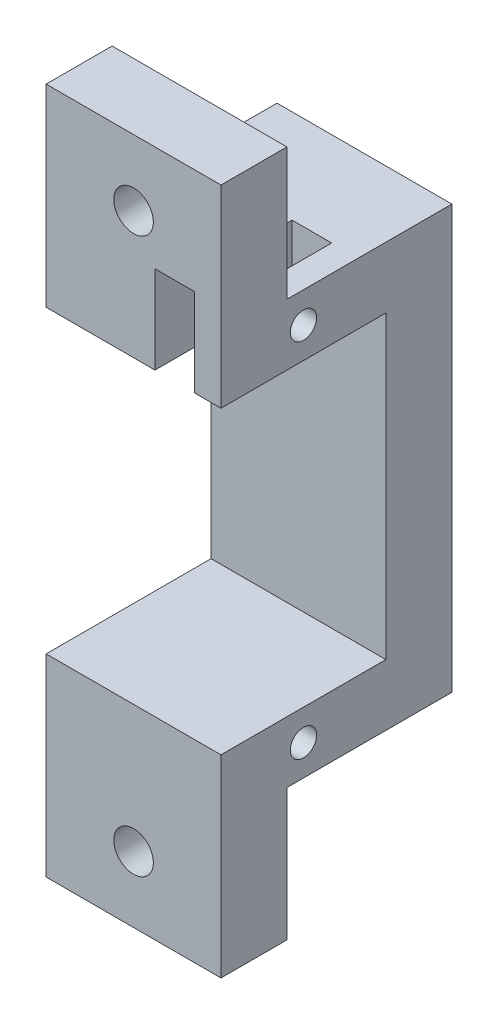
ISO-10303-21;
HEADER;
FILE_DESCRIPTION(('STEP AP214'),'2;1');
FILE_NAME('part.step','',(''),(''),'','','');
FILE_SCHEMA(('AUTOMOTIVE_DESIGN { 1 0 10303 214 1 1 1 1 }'));
ENDSEC;
DATA;
#1=APPLICATION_CONTEXT('core data for automotive mechanical design processes');
#2=APPLICATION_PROTOCOL_DEFINITION('international standard','automotive_design',2000,#1);
#3=PRODUCT_CONTEXT('',#1,'mechanical');
#4=PRODUCT('Part','Part','',(#3));
#5=PRODUCT_RELATED_PRODUCT_CATEGORY('part','',(#4));
#6=PRODUCT_DEFINITION_FORMATION('','',#4);
#7=PRODUCT_DEFINITION_CONTEXT('part definition',#1,'design');
#8=PRODUCT_DEFINITION('design','',#6,#7);
#9=PRODUCT_DEFINITION_SHAPE('','',#8);
#10=(LENGTH_UNIT() NAMED_UNIT(*) SI_UNIT(.MILLI.,.METRE.));
#11=(NAMED_UNIT(*) PLANE_ANGLE_UNIT() SI_UNIT($,.RADIAN.));
#12=(NAMED_UNIT(*) SI_UNIT($,.STERADIAN.) SOLID_ANGLE_UNIT());
#13=UNCERTAINTY_MEASURE_WITH_UNIT(LENGTH_MEASURE(1.E-05),#10,'distance_accuracy_value','');
#14=(GEOMETRIC_REPRESENTATION_CONTEXT(3) GLOBAL_UNCERTAINTY_ASSIGNED_CONTEXT((#13)) GLOBAL_UNIT_ASSIGNED_CONTEXT((#10,
#11,#12)) REPRESENTATION_CONTEXT('',''));
#15=CARTESIAN_POINT('',(0.,0.,0.));
#16=DIRECTION('',(0.,0.,1.));
#17=DIRECTION('',(1.,0.,0.));
#18=AXIS2_PLACEMENT_3D('',#15,#16,#17);
#19=CARTESIAN_POINT('',(-21.7379181981433,-2.325,12.411797698406));
#20=DIRECTION('',(1.,0.,0.));
#21=DIRECTION('',(0.,0.,-1.));
#22=AXIS2_PLACEMENT_3D('',#19,#20,#21);
#23=CYLINDRICAL_SURFACE('',#22,1.);
#24=CARTESIAN_POINT('',(-13.4879181981433,-2.325,12.411797698406));
#25=DIRECTION('',(-1.,0.,0.));
#26=DIRECTION('',(0.,0.,1.));
#27=AXIS2_PLACEMENT_3D('',#24,#25,#26);
#28=CIRCLE('',#27,1.);
#29=CARTESIAN_POINT('',(-13.4879181981433,-2.325,13.411797698406));
#30=VERTEX_POINT('',#29);
#31=EDGE_CURVE('E38',#30,#30,#28,.F.);
#32=ORIENTED_EDGE('',*,*,#31,.T.);
#33=EDGE_LOOP('',(#32));
#34=FACE_BOUND('',#33,.T.);
#35=CARTESIAN_POINT('',(-21.7379181981433,-2.325,12.411797698406));
#36=DIRECTION('',(1.,0.,0.));
#37=DIRECTION('',(0.,0.,-1.));
#38=AXIS2_PLACEMENT_3D('',#35,#36,#37);
#39=CIRCLE('',#38,1.);
#40=CARTESIAN_POINT('',(-21.7379181981433,-2.325,11.411797698406));
#41=VERTEX_POINT('',#40);
#42=EDGE_CURVE('E303',#41,#41,#39,.T.);
#43=ORIENTED_EDGE('',*,*,#42,.F.);
#44=EDGE_LOOP('',(#43));
#45=FACE_BOUND('',#44,.T.);
#46=ADVANCED_FACE('F34',(#34,#45),#23,.F.);
#47=CARTESIAN_POINT('',(-21.7379181981433,-32.05,1.16179769840603));
#48=DIRECTION('',(0.,1.,0.));
#49=DIRECTION('',(-1.,0.,0.));
#50=AXIS2_PLACEMENT_3D('',#47,#48,#49);
#51=PLANE('',#50);
#52=DIRECTION('',(1.,0.,0.));
#53=VECTOR('',#52,1.);
#54=CARTESIAN_POINT('',(-21.7379181981433,-32.05,13.661797698406));
#55=LINE('',#54,#53);
#56=CARTESIAN_POINT('',(-21.7379181981433,-32.05,13.661797698406));
#57=VERTEX_POINT('',#56);
#58=CARTESIAN_POINT('',(-8.48791819814331,-32.05,13.661797698406));
#59=VERTEX_POINT('',#58);
#60=EDGE_CURVE('E204',#57,#59,#55,.T.);
#61=ORIENTED_EDGE('',*,*,#60,.F.);
#62=DIRECTION('',(0.,0.,1.));
#63=VECTOR('',#62,1.);
#64=CARTESIAN_POINT('',(-21.7379181981433,-32.05,1.16179769840603));
#65=LINE('',#64,#63);
#66=CARTESIAN_POINT('',(-21.7379181981433,-32.05,1.16179769840603));
#67=VERTEX_POINT('',#66);
#68=EDGE_CURVE('E250',#67,#57,#65,.T.);
#69=ORIENTED_EDGE('',*,*,#68,.F.);
#70=DIRECTION('',(-1.,0.,0.));
#71=VECTOR('',#70,1.);
#72=CARTESIAN_POINT('',(-21.7379181981433,-32.05,1.16179769840603));
#73=LINE('',#72,#71);
#74=CARTESIAN_POINT('',(-8.48791819814331,-32.05,1.16179769840603));
#75=VERTEX_POINT('',#74);
#76=EDGE_CURVE('E248',#75,#67,#73,.T.);
#77=ORIENTED_EDGE('',*,*,#76,.F.);
#78=DIRECTION('',(0.,0.,1.));
#79=VECTOR('',#78,1.);
#80=CARTESIAN_POINT('',(-8.48791819814331,-32.05,1.16179769840603));
#81=LINE('',#80,#79);
#82=EDGE_CURVE('E256',#75,#59,#81,.T.);
#83=ORIENTED_EDGE('',*,*,#82,.T.);
#84=EDGE_LOOP('',(#61,#69,#77,#83));
#85=FACE_BOUND('',#84,.T.);
#86=ADVANCED_FACE('F385',(#85),#51,.F.);
#87=CARTESIAN_POINT('',(0.,0.,6.16179769840603));
#88=DIRECTION('',(0.,0.,1.));
#89=DIRECTION('',(1.,0.,0.));
#90=AXIS2_PLACEMENT_3D('',#87,#88,#89);
#91=PLANE('',#90);
#92=DIRECTION('',(0.,1.,0.));
#93=VECTOR('',#92,1.);
#94=CARTESIAN_POINT('',(-21.7379181981433,0.,6.16179769840603));
#95=LINE('',#94,#93);
#96=CARTESIAN_POINT('',(-21.7379181981433,-27.4,6.16179769840603));
#97=VERTEX_POINT('',#96);
#98=CARTESIAN_POINT('',(-21.7379181981433,-4.65,6.16179769840603));
#99=VERTEX_POINT('',#98);
#100=EDGE_CURVE('E238',#97,#99,#95,.T.);
#101=ORIENTED_EDGE('',*,*,#100,.F.);
#102=DIRECTION('',(-1.,0.,0.));
#103=VECTOR('',#102,1.);
#104=CARTESIAN_POINT('',(-8.48791819814331,-27.4,6.16179769840603));
#105=LINE('',#104,#103);
#106=CARTESIAN_POINT('',(-8.48791819814331,-27.4,6.16179769840603));
#107=VERTEX_POINT('',#106);
#108=EDGE_CURVE('E224',#107,#97,#105,.T.);
#109=ORIENTED_EDGE('',*,*,#108,.F.);
#110=DIRECTION('',(0.,-1.,0.));
#111=VECTOR('',#110,1.);
#112=CARTESIAN_POINT('',(-8.4879181981433,0.,6.16179769840603));
#113=LINE('',#112,#111);
#114=CARTESIAN_POINT('',(-8.4879181981433,-4.65,6.16179769840603));
#115=VERTEX_POINT('',#114);
#116=EDGE_CURVE('E243',#115,#107,#113,.T.);
#117=ORIENTED_EDGE('',*,*,#116,.F.);
#118=DIRECTION('',(-1.,0.,0.));
#119=VECTOR('',#118,1.);
#120=CARTESIAN_POINT('',(-21.7379181981433,-4.65,6.16179769840603));
#121=LINE('',#120,#119);
#122=EDGE_CURVE('E268',#115,#99,#121,.T.);
#123=ORIENTED_EDGE('',*,*,#122,.T.);
#124=EDGE_LOOP('',(#101,#109,#117,#123));
#125=FACE_BOUND('',#124,.T.);
#126=ADVANCED_FACE('F362',(#125),#91,.T.);
#127=CARTESIAN_POINT('',(-21.7379181981433,-4.65,6.16179769840603));
#128=DIRECTION('',(-1.,0.,0.));
#129=DIRECTION('',(0.,0.,1.));
#130=AXIS2_PLACEMENT_3D('',#127,#128,#129);
#131=PLANE('',#130);
#132=CARTESIAN_POINT('',(-21.7379181981433,-29.725,12.411797698406));
#133=DIRECTION('',(1.,0.,0.));
#134=DIRECTION('',(0.,0.,-1.));
#135=AXIS2_PLACEMENT_3D('',#132,#133,#134);
#136=CIRCLE('',#135,1.);
#137=CARTESIAN_POINT('',(-21.7379181981433,-29.725,11.411797698406));
#138=VERTEX_POINT('',#137);
#139=EDGE_CURVE('E297',#138,#138,#136,.T.);
#140=ORIENTED_EDGE('',*,*,#139,.T.);
#141=EDGE_LOOP('',(#140));
#142=FACE_BOUND('',#141,.T.);
#143=ORIENTED_EDGE('',*,*,#42,.T.);
#144=EDGE_LOOP('',(#143));
#145=FACE_BOUND('',#144,.T.);
#146=DIRECTION('',(0.,0.,1.));
#147=VECTOR('',#146,1.);
#148=CARTESIAN_POINT('',(-21.7379181981433,0.,6.16179769840603));
#149=LINE('',#148,#147);
#150=CARTESIAN_POINT('',(-21.7379181981433,0.,1.16179769840603));
#151=VERTEX_POINT('',#150);
#152=CARTESIAN_POINT('',(-21.7379181981433,0.,13.661797698406));
#153=VERTEX_POINT('',#152);
#154=EDGE_CURVE('E187',#151,#153,#149,.T.);
#155=ORIENTED_EDGE('',*,*,#154,.F.);
#156=DIRECTION('',(0.,1.,0.));
#157=VECTOR('',#156,1.);
#158=CARTESIAN_POINT('',(-21.7379181981433,0.,1.16179769840603));
#159=LINE('',#158,#157);
#160=EDGE_CURVE('E239',#67,#151,#159,.T.);
#161=ORIENTED_EDGE('',*,*,#160,.F.);
#162=ORIENTED_EDGE('',*,*,#68,.T.);
#163=DIRECTION('',(0.,1.,0.));
#164=VECTOR('',#163,1.);
#165=CARTESIAN_POINT('',(-21.7379181981433,-42.05,13.661797698406));
#166=LINE('',#165,#164);
#167=CARTESIAN_POINT('',(-21.7379181981433,-42.05,13.661797698406));
#168=VERTEX_POINT('',#167);
#169=EDGE_CURVE('E221',#168,#57,#166,.T.);
#170=ORIENTED_EDGE('',*,*,#169,.F.);
#171=DIRECTION('',(0.,0.,-1.));
#172=VECTOR('',#171,1.);
#173=CARTESIAN_POINT('',(-21.7379181981433,-42.05,18.661797698406));
#174=LINE('',#173,#172);
#175=CARTESIAN_POINT('',(-21.7379181981433,-42.05,18.661797698406));
#176=VERTEX_POINT('',#175);
#177=EDGE_CURVE('E205',#176,#168,#174,.T.);
#178=ORIENTED_EDGE('',*,*,#177,.F.);
#179=DIRECTION('',(0.,-1.,0.));
#180=VECTOR('',#179,1.);
#181=CARTESIAN_POINT('',(-21.7379181981433,-32.05,18.661797698406));
#182=LINE('',#181,#180);
#183=CARTESIAN_POINT('',(-21.7379181981433,-27.4,18.661797698406));
#184=VERTEX_POINT('',#183);
#185=EDGE_CURVE('E230',#184,#176,#182,.T.);
#186=ORIENTED_EDGE('',*,*,#185,.F.);
#187=DIRECTION('',(0.,0.,-1.));
#188=VECTOR('',#187,1.);
#189=CARTESIAN_POINT('',(-21.7379181981433,-27.4,18.661797698406));
#190=LINE('',#189,#188);
#191=EDGE_CURVE('E232',#184,#97,#190,.T.);
#192=ORIENTED_EDGE('',*,*,#191,.T.);
#193=ORIENTED_EDGE('',*,*,#100,.T.);
#194=DIRECTION('',(0.,0.,1.));
#195=VECTOR('',#194,1.);
#196=CARTESIAN_POINT('',(-21.7379181981433,-4.65,6.16179769840603));
#197=LINE('',#196,#195);
#198=CARTESIAN_POINT('',(-21.7379181981433,-4.65,18.661797698406));
#199=VERTEX_POINT('',#198);
#200=EDGE_CURVE('E258',#99,#199,#197,.T.);
#201=ORIENTED_EDGE('',*,*,#200,.T.);
#202=DIRECTION('',(0.,1.,0.));
#203=VECTOR('',#202,1.);
#204=CARTESIAN_POINT('',(-21.7379181981433,-4.65,18.661797698406));
#205=LINE('',#204,#203);
#206=CARTESIAN_POINT('',(-21.7379181981433,10.,18.661797698406));
#207=VERTEX_POINT('',#206);
#208=EDGE_CURVE('E43',#199,#207,#205,.T.);
#209=ORIENTED_EDGE('',*,*,#208,.T.);
#210=DIRECTION('',(0.,0.,1.));
#211=VECTOR('',#210,1.);
#212=CARTESIAN_POINT('',(-21.7379181981433,10.,18.661797698406));
#213=LINE('',#212,#211);
#214=CARTESIAN_POINT('',(-21.7379181981433,10.,13.661797698406));
#215=VERTEX_POINT('',#214);
#216=EDGE_CURVE('E191',#215,#207,#213,.T.);
#217=ORIENTED_EDGE('',*,*,#216,.F.);
#218=DIRECTION('',(0.,-1.,0.));
#219=VECTOR('',#218,1.);
#220=CARTESIAN_POINT('',(-21.7379181981433,10.,13.661797698406));
#221=LINE('',#220,#219);
#222=EDGE_CURVE('E199',#215,#153,#221,.T.);
#223=ORIENTED_EDGE('',*,*,#222,.T.);
#224=EDGE_LOOP('',(#155,#161,#162,#170,#178,#186,#192,#193,#201,#209,#217,#223));
#225=FACE_BOUND('',#224,.T.);
#226=ADVANCED_FACE('F36',(#142,#145,#225),#131,.T.);
#227=CARTESIAN_POINT('',(-8.4879181981433,-4.65,6.16179769840603));
#228=DIRECTION('',(1.,0.,0.));
#229=DIRECTION('',(0.,0.,-1.));
#230=AXIS2_PLACEMENT_3D('',#227,#228,#229);
#231=PLANE('',#230);
#232=CARTESIAN_POINT('',(-8.4879181981433,-29.725,12.411797698406));
#233=DIRECTION('',(1.,0.,0.));
#234=DIRECTION('',(0.,0.,-1.));
#235=AXIS2_PLACEMENT_3D('',#232,#233,#234);
#236=CIRCLE('',#235,1.);
#237=CARTESIAN_POINT('',(-8.4879181981433,-29.725,11.411797698406));
#238=VERTEX_POINT('',#237);
#239=EDGE_CURVE('E296',#238,#238,#236,.T.);
#240=ORIENTED_EDGE('',*,*,#239,.F.);
#241=EDGE_LOOP('',(#240));
#242=FACE_BOUND('',#241,.T.);
#243=CARTESIAN_POINT('',(-8.4879181981433,-2.325,12.411797698406));
#244=DIRECTION('',(1.,0.,0.));
#245=DIRECTION('',(0.,0.,-1.));
#246=AXIS2_PLACEMENT_3D('',#243,#244,#245);
#247=CIRCLE('',#246,1.);
#248=CARTESIAN_POINT('',(-8.4879181981433,-2.325,11.411797698406));
#249=VERTEX_POINT('',#248);
#250=EDGE_CURVE('E300',#249,#249,#247,.T.);
#251=ORIENTED_EDGE('',*,*,#250,.F.);
#252=EDGE_LOOP('',(#251));
#253=FACE_BOUND('',#252,.T.);
#254=DIRECTION('',(0.,0.,-1.));
#255=VECTOR('',#254,1.);
#256=CARTESIAN_POINT('',(-8.4879181981433,0.,6.16179769840603));
#257=LINE('',#256,#255);
#258=CARTESIAN_POINT('',(-8.4879181981433,0.,13.661797698406));
#259=VERTEX_POINT('',#258);
#260=CARTESIAN_POINT('',(-8.4879181981433,0.,1.16179769840603));
#261=VERTEX_POINT('',#260);
#262=EDGE_CURVE('E262',#259,#261,#257,.T.);
#263=ORIENTED_EDGE('',*,*,#262,.F.);
#264=DIRECTION('',(0.,-1.,0.));
#265=VECTOR('',#264,1.);
#266=CARTESIAN_POINT('',(-8.4879181981433,10.,13.661797698406));
#267=LINE('',#266,#265);
#268=CARTESIAN_POINT('',(-8.4879181981433,10.,13.661797698406));
#269=VERTEX_POINT('',#268);
#270=EDGE_CURVE('E201',#269,#259,#267,.T.);
#271=ORIENTED_EDGE('',*,*,#270,.F.);
#272=DIRECTION('',(0.,0.,-1.));
#273=VECTOR('',#272,1.);
#274=CARTESIAN_POINT('',(-8.4879181981433,10.,18.661797698406));
#275=LINE('',#274,#273);
#276=CARTESIAN_POINT('',(-8.4879181981433,10.,18.661797698406));
#277=VERTEX_POINT('',#276);
#278=EDGE_CURVE('E320',#277,#269,#275,.T.);
#279=ORIENTED_EDGE('',*,*,#278,.F.);
#280=DIRECTION('',(0.,1.,0.));
#281=VECTOR('',#280,1.);
#282=CARTESIAN_POINT('',(-8.4879181981433,-4.65,18.661797698406));
#283=LINE('',#282,#281);
#284=CARTESIAN_POINT('',(-8.4879181981433,-4.65,18.661797698406));
#285=VERTEX_POINT('',#284);
#286=EDGE_CURVE('E11',#285,#277,#283,.T.);
#287=ORIENTED_EDGE('',*,*,#286,.F.);
#288=DIRECTION('',(0.,0.,-1.));
#289=VECTOR('',#288,1.);
#290=CARTESIAN_POINT('',(-8.4879181981433,-4.65,6.16179769840603));
#291=LINE('',#290,#289);
#292=EDGE_CURVE('E266',#285,#115,#291,.T.);
#293=ORIENTED_EDGE('',*,*,#292,.T.);
#294=ORIENTED_EDGE('',*,*,#116,.T.);
#295=DIRECTION('',(0.,0.,-1.));
#296=VECTOR('',#295,1.);
#297=CARTESIAN_POINT('',(-8.48791819814331,-27.4,18.661797698406));
#298=LINE('',#297,#296);
#299=CARTESIAN_POINT('',(-8.48791819814331,-27.4,18.661797698406));
#300=VERTEX_POINT('',#299);
#301=EDGE_CURVE('E236',#300,#107,#298,.T.);
#302=ORIENTED_EDGE('',*,*,#301,.F.);
#303=DIRECTION('',(0.,1.,0.));
#304=VECTOR('',#303,1.);
#305=CARTESIAN_POINT('',(-8.48791819814331,-32.05,18.661797698406));
#306=LINE('',#305,#304);
#307=CARTESIAN_POINT('',(-8.48791819814331,-42.05,18.661797698406));
#308=VERTEX_POINT('',#307);
#309=EDGE_CURVE('E225',#308,#300,#306,.T.);
#310=ORIENTED_EDGE('',*,*,#309,.F.);
#311=DIRECTION('',(0.,0.,1.));
#312=VECTOR('',#311,1.);
#313=CARTESIAN_POINT('',(-8.48791819814331,-42.05,18.661797698406));
#314=LINE('',#313,#312);
#315=CARTESIAN_POINT('',(-8.48791819814331,-42.05,13.661797698406));
#316=VERTEX_POINT('',#315);
#317=EDGE_CURVE('E210',#316,#308,#314,.T.);
#318=ORIENTED_EDGE('',*,*,#317,.F.);
#319=DIRECTION('',(0.,1.,0.));
#320=VECTOR('',#319,1.);
#321=CARTESIAN_POINT('',(-8.48791819814331,-42.05,13.661797698406));
#322=LINE('',#321,#320);
#323=EDGE_CURVE('E216',#316,#59,#322,.T.);
#324=ORIENTED_EDGE('',*,*,#323,.T.);
#325=ORIENTED_EDGE('',*,*,#82,.F.);
#326=DIRECTION('',(0.,-1.,0.));
#327=VECTOR('',#326,1.);
#328=CARTESIAN_POINT('',(-8.4879181981433,0.,1.16179769840603));
#329=LINE('',#328,#327);
#330=EDGE_CURVE('E246',#261,#75,#329,.T.);
#331=ORIENTED_EDGE('',*,*,#330,.F.);
#332=EDGE_LOOP('',(#263,#271,#279,#287,#293,#294,#302,#310,#318,#324,#325,#331));
#333=FACE_BOUND('',#332,.T.);
#334=ADVANCED_FACE('F337',(#242,#253,#333),#231,.T.);
#335=CARTESIAN_POINT('',(-21.7379181981433,-4.65,18.661797698406));
#336=DIRECTION('',(0.,0.,1.));
#337=DIRECTION('',(1.,0.,0.));
#338=AXIS2_PLACEMENT_3D('',#335,#336,#337);
#339=PLANE('',#338);
#340=DIRECTION('',(-1.,0.,0.));
#341=VECTOR('',#340,1.);
#342=CARTESIAN_POINT('',(-21.7379181981433,2.,18.661797698406));
#343=LINE('',#342,#341);
#344=CARTESIAN_POINT('',(-10.4879181981433,2.,18.661797698406));
#345=VERTEX_POINT('',#344);
#346=CARTESIAN_POINT('',(-13.4879181981433,2.,18.661797698406));
#347=VERTEX_POINT('',#346);
#348=EDGE_CURVE('E183',#345,#347,#343,.T.);
#349=ORIENTED_EDGE('',*,*,#348,.F.);
#350=DIRECTION('',(0.,1.,0.));
#351=VECTOR('',#350,1.);
#352=CARTESIAN_POINT('',(-10.4879181981433,-10.,18.661797698406));
#353=LINE('',#352,#351);
#354=CARTESIAN_POINT('',(-10.4879181981433,-4.65,18.661797698406));
#355=VERTEX_POINT('',#354);
#356=EDGE_CURVE('E281',#355,#345,#353,.T.);
#357=ORIENTED_EDGE('',*,*,#356,.F.);
#358=DIRECTION('',(1.,0.,0.));
#359=VECTOR('',#358,1.);
#360=CARTESIAN_POINT('',(-21.7379181981433,-4.65,18.661797698406));
#361=LINE('',#360,#359);
#362=EDGE_CURVE('E261',#355,#285,#361,.T.);
#363=ORIENTED_EDGE('',*,*,#362,.T.);
#364=ORIENTED_EDGE('',*,*,#286,.T.);
#365=DIRECTION('',(1.,0.,0.));
#366=VECTOR('',#365,1.);
#367=CARTESIAN_POINT('',(-21.7379181981433,10.,18.661797698406));
#368=LINE('',#367,#366);
#369=EDGE_CURVE('E318',#207,#277,#368,.T.);
#370=ORIENTED_EDGE('',*,*,#369,.F.);
#371=ORIENTED_EDGE('',*,*,#208,.F.);
#372=CARTESIAN_POINT('',(-13.4879181981433,-4.65,18.661797698406));
#373=VERTEX_POINT('',#372);
#374=EDGE_CURVE('E263',#199,#373,#361,.T.);
#375=ORIENTED_EDGE('',*,*,#374,.T.);
#376=DIRECTION('',(0.,1.,0.));
#377=VECTOR('',#376,1.);
#378=CARTESIAN_POINT('',(-13.4879181981433,-10.,18.661797698406));
#379=LINE('',#378,#377);
#380=EDGE_CURVE('E288',#373,#347,#379,.T.);
#381=ORIENTED_EDGE('',*,*,#380,.T.);
#382=EDGE_LOOP('',(#349,#357,#363,#364,#370,#371,#375,#381));
#383=FACE_BOUND('',#382,.T.);
#384=CARTESIAN_POINT('',(-15.1129181981433,5.,18.661797698406));
#385=DIRECTION('',(0.,0.,1.));
#386=DIRECTION('',(1.,0.,0.));
#387=AXIS2_PLACEMENT_3D('',#384,#385,#386);
#388=CIRCLE('',#387,1.5);
#389=CARTESIAN_POINT('',(-13.6129181981433,5.,18.661797698406));
#390=VERTEX_POINT('',#389);
#391=EDGE_CURVE('E189',#390,#390,#388,.T.);
#392=ORIENTED_EDGE('',*,*,#391,.F.);
#393=EDGE_LOOP('',(#392));
#394=FACE_BOUND('',#393,.T.);
#395=ADVANCED_FACE('F333',(#383,#394),#339,.T.);
#396=CARTESIAN_POINT('',(0.,-4.65,0.));
#397=DIRECTION('',(0.,1.,0.));
#398=DIRECTION('',(0.,0.,1.));
#399=AXIS2_PLACEMENT_3D('',#396,#397,#398);
#400=PLANE('',#399);
#401=DIRECTION('',(-1.,0.,0.));
#402=VECTOR('',#401,1.);
#403=CARTESIAN_POINT('',(0.,-4.65,8.27082062568252));
#404=LINE('',#403,#402);
#405=CARTESIAN_POINT('',(-10.4879181981433,-4.65,8.27082062568252));
#406=VERTEX_POINT('',#405);
#407=CARTESIAN_POINT('',(-13.4879181981433,-4.65,8.27082062568252));
#408=VERTEX_POINT('',#407);
#409=EDGE_CURVE('E293',#406,#408,#404,.T.);
#410=ORIENTED_EDGE('',*,*,#409,.T.);
#411=DIRECTION('',(0.,0.,1.));
#412=VECTOR('',#411,1.);
#413=CARTESIAN_POINT('',(-13.4879181981433,-4.65,0.));
#414=LINE('',#413,#412);
#415=EDGE_CURVE('E290',#408,#373,#414,.T.);
#416=ORIENTED_EDGE('',*,*,#415,.T.);
#417=ORIENTED_EDGE('',*,*,#374,.F.);
#418=ORIENTED_EDGE('',*,*,#200,.F.);
#419=ORIENTED_EDGE('',*,*,#122,.F.);
#420=ORIENTED_EDGE('',*,*,#292,.F.);
#421=ORIENTED_EDGE('',*,*,#362,.F.);
#422=DIRECTION('',(0.,0.,-1.));
#423=VECTOR('',#422,1.);
#424=CARTESIAN_POINT('',(-10.4879181981433,-4.65,0.));
#425=LINE('',#424,#423);
#426=EDGE_CURVE('E275',#355,#406,#425,.T.);
#427=ORIENTED_EDGE('',*,*,#426,.T.);
#428=EDGE_LOOP('',(#410,#416,#417,#418,#419,#420,#421,#427));
#429=FACE_BOUND('',#428,.T.);
#430=ADVANCED_FACE('F352',(#429),#400,.F.);
#431=CARTESIAN_POINT('',(0.,0.,0.));
#432=DIRECTION('',(0.,1.,0.));
#433=DIRECTION('',(0.,0.,1.));
#434=AXIS2_PLACEMENT_3D('',#431,#432,#433);
#435=PLANE('',#434);
#436=DIRECTION('',(0.,0.,1.));
#437=VECTOR('',#436,1.);
#438=CARTESIAN_POINT('',(-13.4879181981433,0.,18.661797698406));
#439=LINE('',#438,#437);
#440=CARTESIAN_POINT('',(-13.4879181981433,0.,8.27082062568252));
#441=VERTEX_POINT('',#440);
#442=CARTESIAN_POINT('',(-13.4879181981433,0.,13.661797698406));
#443=VERTEX_POINT('',#442);
#444=EDGE_CURVE('E176',#441,#443,#439,.T.);
#445=ORIENTED_EDGE('',*,*,#444,.F.);
#446=DIRECTION('',(-1.,0.,0.));
#447=VECTOR('',#446,1.);
#448=CARTESIAN_POINT('',(-13.4879181981433,0.,8.27082062568252));
#449=LINE('',#448,#447);
#450=CARTESIAN_POINT('',(-10.4879181981433,0.,8.27082062568252));
#451=VERTEX_POINT('',#450);
#452=EDGE_CURVE('E284',#451,#441,#449,.T.);
#453=ORIENTED_EDGE('',*,*,#452,.F.);
#454=DIRECTION('',(0.,0.,-1.));
#455=VECTOR('',#454,1.);
#456=CARTESIAN_POINT('',(-10.4879181981433,0.,18.661797698406));
#457=LINE('',#456,#455);
#458=CARTESIAN_POINT('',(-10.4879181981433,0.,13.661797698406));
#459=VERTEX_POINT('',#458);
#460=EDGE_CURVE('E182',#459,#451,#457,.T.);
#461=ORIENTED_EDGE('',*,*,#460,.F.);
#462=DIRECTION('',(-1.,0.,0.));
#463=VECTOR('',#462,1.);
#464=CARTESIAN_POINT('',(-21.7379181981433,0.,13.661797698406));
#465=LINE('',#464,#463);
#466=EDGE_CURVE('E59',#259,#459,#465,.T.);
#467=ORIENTED_EDGE('',*,*,#466,.F.);
#468=ORIENTED_EDGE('',*,*,#262,.T.);
#469=DIRECTION('',(1.,0.,0.));
#470=VECTOR('',#469,1.);
#471=CARTESIAN_POINT('',(-21.7379181981433,0.,1.16179769840603));
#472=LINE('',#471,#470);
#473=EDGE_CURVE('E242',#151,#261,#472,.T.);
#474=ORIENTED_EDGE('',*,*,#473,.F.);
#475=ORIENTED_EDGE('',*,*,#154,.T.);
#476=EDGE_CURVE('E166',#443,#153,#465,.T.);
#477=ORIENTED_EDGE('',*,*,#476,.F.);
#478=EDGE_LOOP('',(#445,#453,#461,#467,#468,#474,#475,#477));
#479=FACE_BOUND('',#478,.T.);
#480=ADVANCED_FACE('F185',(#479),#435,.T.);
#481=CARTESIAN_POINT('',(0.,0.,1.16179769840603));
#482=DIRECTION('',(0.,0.,1.));
#483=DIRECTION('',(1.,0.,0.));
#484=AXIS2_PLACEMENT_3D('',#481,#482,#483);
#485=PLANE('',#484);
#486=ORIENTED_EDGE('',*,*,#160,.T.);
#487=ORIENTED_EDGE('',*,*,#473,.T.);
#488=ORIENTED_EDGE('',*,*,#330,.T.);
#489=ORIENTED_EDGE('',*,*,#76,.T.);
#490=EDGE_LOOP('',(#486,#487,#488,#489));
#491=FACE_BOUND('',#490,.T.);
#492=ADVANCED_FACE('F387',(#491),#485,.F.);
#493=CARTESIAN_POINT('',(-8.48791819814331,-27.4,18.661797698406));
#494=DIRECTION('',(0.,-1.,0.));
#495=DIRECTION('',(1.,0.,0.));
#496=AXIS2_PLACEMENT_3D('',#493,#494,#495);
#497=PLANE('',#496);
#498=ORIENTED_EDGE('',*,*,#108,.T.);
#499=ORIENTED_EDGE('',*,*,#191,.F.);
#500=DIRECTION('',(-1.,0.,0.));
#501=VECTOR('',#500,1.);
#502=CARTESIAN_POINT('',(-8.48791819814331,-27.4,18.661797698406));
#503=LINE('',#502,#501);
#504=EDGE_CURVE('E228',#300,#184,#503,.T.);
#505=ORIENTED_EDGE('',*,*,#504,.F.);
#506=ORIENTED_EDGE('',*,*,#301,.T.);
#507=EDGE_LOOP('',(#498,#499,#505,#506));
#508=FACE_BOUND('',#507,.T.);
#509=ADVANCED_FACE('F367',(#508),#497,.F.);
#510=CARTESIAN_POINT('',(0.,0.,18.661797698406));
#511=DIRECTION('',(0.,0.,1.));
#512=DIRECTION('',(1.,0.,0.));
#513=AXIS2_PLACEMENT_3D('',#510,#511,#512);
#514=PLANE('',#513);
#515=CARTESIAN_POINT('',(-15.1129181981433,-37.05,18.661797698406));
#516=DIRECTION('',(0.,0.,1.));
#517=DIRECTION('',(1.,0.,0.));
#518=AXIS2_PLACEMENT_3D('',#515,#516,#517);
#519=CIRCLE('',#518,1.5);
#520=CARTESIAN_POINT('',(-13.6129181981433,-37.05,18.661797698406));
#521=VERTEX_POINT('',#520);
#522=EDGE_CURVE('E311',#521,#521,#519,.T.);
#523=ORIENTED_EDGE('',*,*,#522,.F.);
#524=EDGE_LOOP('',(#523));
#525=FACE_BOUND('',#524,.T.);
#526=ORIENTED_EDGE('',*,*,#309,.T.);
#527=ORIENTED_EDGE('',*,*,#504,.T.);
#528=ORIENTED_EDGE('',*,*,#185,.T.);
#529=DIRECTION('',(-1.,0.,0.));
#530=VECTOR('',#529,1.);
#531=CARTESIAN_POINT('',(-21.7379181981433,-42.05,18.661797698406));
#532=LINE('',#531,#530);
#533=EDGE_CURVE('E213',#308,#176,#532,.T.);
#534=ORIENTED_EDGE('',*,*,#533,.F.);
#535=EDGE_LOOP('',(#526,#527,#528,#534));
#536=FACE_BOUND('',#535,.T.);
#537=ADVANCED_FACE('F372',(#525,#536),#514,.T.);
#538=CARTESIAN_POINT('',(-21.7379181981433,-42.05,13.661797698406));
#539=DIRECTION('',(0.,0.,1.));
#540=DIRECTION('',(1.,0.,0.));
#541=AXIS2_PLACEMENT_3D('',#538,#539,#540);
#542=PLANE('',#541);
#543=CARTESIAN_POINT('',(-15.1129181981433,-37.05,13.661797698406));
#544=DIRECTION('',(0.,0.,-1.));
#545=DIRECTION('',(-1.,0.,0.));
#546=AXIS2_PLACEMENT_3D('',#543,#544,#545);
#547=CIRCLE('',#546,1.5);
#548=CARTESIAN_POINT('',(-16.6129181981433,-37.05,13.661797698406));
#549=VERTEX_POINT('',#548);
#550=EDGE_CURVE('E306',#549,#549,#547,.T.);
#551=ORIENTED_EDGE('',*,*,#550,.F.);
#552=EDGE_LOOP('',(#551));
#553=FACE_BOUND('',#552,.T.);
#554=ORIENTED_EDGE('',*,*,#60,.T.);
#555=ORIENTED_EDGE('',*,*,#323,.F.);
#556=DIRECTION('',(1.,0.,0.));
#557=VECTOR('',#556,1.);
#558=CARTESIAN_POINT('',(-21.7379181981433,-42.05,13.661797698406));
#559=LINE('',#558,#557);
#560=EDGE_CURVE('E208',#168,#316,#559,.T.);
#561=ORIENTED_EDGE('',*,*,#560,.F.);
#562=ORIENTED_EDGE('',*,*,#169,.T.);
#563=EDGE_LOOP('',(#554,#555,#561,#562));
#564=FACE_BOUND('',#563,.T.);
#565=ADVANCED_FACE('F380',(#553,#564),#542,.F.);
#566=CARTESIAN_POINT('',(0.,-42.05,0.));
#567=DIRECTION('',(0.,-1.,0.));
#568=DIRECTION('',(1.,0.,0.));
#569=AXIS2_PLACEMENT_3D('',#566,#567,#568);
#570=PLANE('',#569);
#571=ORIENTED_EDGE('',*,*,#177,.T.);
#572=ORIENTED_EDGE('',*,*,#560,.T.);
#573=ORIENTED_EDGE('',*,*,#317,.T.);
#574=ORIENTED_EDGE('',*,*,#533,.T.);
#575=EDGE_LOOP('',(#571,#572,#573,#574));
#576=FACE_BOUND('',#575,.T.);
#577=ADVANCED_FACE('F375',(#576),#570,.T.);
#578=CARTESIAN_POINT('',(-21.7379181981433,10.,13.661797698406));
#579=DIRECTION('',(0.,0.,1.));
#580=DIRECTION('',(1.,0.,0.));
#581=AXIS2_PLACEMENT_3D('',#578,#579,#580);
#582=PLANE('',#581);
#583=CARTESIAN_POINT('',(-15.1129181981433,5.,13.661797698406));
#584=DIRECTION('',(0.,0.,-1.));
#585=DIRECTION('',(-1.,0.,0.));
#586=AXIS2_PLACEMENT_3D('',#583,#584,#585);
#587=CIRCLE('',#586,1.5);
#588=CARTESIAN_POINT('',(-16.6129181981433,5.,13.661797698406));
#589=VERTEX_POINT('',#588);
#590=EDGE_CURVE('E193',#589,#589,#587,.T.);
#591=ORIENTED_EDGE('',*,*,#590,.F.);
#592=EDGE_LOOP('',(#591));
#593=FACE_BOUND('',#592,.T.);
#594=ORIENTED_EDGE('',*,*,#466,.T.);
#595=DIRECTION('',(0.,-1.,0.));
#596=VECTOR('',#595,1.);
#597=CARTESIAN_POINT('',(-10.4879181981433,0.,13.661797698406));
#598=LINE('',#597,#596);
#599=CARTESIAN_POINT('',(-10.4879181981433,2.,13.661797698406));
#600=VERTEX_POINT('',#599);
#601=EDGE_CURVE('E173',#600,#459,#598,.T.);
#602=ORIENTED_EDGE('',*,*,#601,.F.);
#603=DIRECTION('',(1.,0.,0.));
#604=VECTOR('',#603,1.);
#605=CARTESIAN_POINT('',(-10.4879181981433,2.,13.661797698406));
#606=LINE('',#605,#604);
#607=CARTESIAN_POINT('',(-13.4879181981433,2.,13.661797698406));
#608=VERTEX_POINT('',#607);
#609=EDGE_CURVE('E170',#608,#600,#606,.T.);
#610=ORIENTED_EDGE('',*,*,#609,.F.);
#611=DIRECTION('',(0.,1.,0.));
#612=VECTOR('',#611,1.);
#613=CARTESIAN_POINT('',(-13.4879181981433,0.,13.661797698406));
#614=LINE('',#613,#612);
#615=EDGE_CURVE('E161',#443,#608,#614,.T.);
#616=ORIENTED_EDGE('',*,*,#615,.F.);
#617=ORIENTED_EDGE('',*,*,#476,.T.);
#618=ORIENTED_EDGE('',*,*,#222,.F.);
#619=DIRECTION('',(-1.,0.,0.));
#620=VECTOR('',#619,1.);
#621=CARTESIAN_POINT('',(-21.7379181981433,10.,13.661797698406));
#622=LINE('',#621,#620);
#623=EDGE_CURVE('E197',#269,#215,#622,.T.);
#624=ORIENTED_EDGE('',*,*,#623,.F.);
#625=ORIENTED_EDGE('',*,*,#270,.T.);
#626=EDGE_LOOP('',(#594,#602,#610,#616,#617,#618,#624,#625));
#627=FACE_BOUND('',#626,.T.);
#628=ADVANCED_FACE('F163',(#593,#627),#582,.F.);
#629=CARTESIAN_POINT('',(0.,10.,0.));
#630=DIRECTION('',(0.,-1.,0.));
#631=DIRECTION('',(0.,0.,-1.));
#632=AXIS2_PLACEMENT_3D('',#629,#630,#631);
#633=PLANE('',#632);
#634=ORIENTED_EDGE('',*,*,#216,.T.);
#635=ORIENTED_EDGE('',*,*,#369,.T.);
#636=ORIENTED_EDGE('',*,*,#278,.T.);
#637=ORIENTED_EDGE('',*,*,#623,.T.);
#638=EDGE_LOOP('',(#634,#635,#636,#637));
#639=FACE_BOUND('',#638,.T.);
#640=ADVANCED_FACE('F325',(#639),#633,.F.);
#641=CARTESIAN_POINT('',(-15.1129181981433,5.,23.661797698406));
#642=DIRECTION('',(0.,0.,-1.));
#643=DIRECTION('',(-1.,0.,0.));
#644=AXIS2_PLACEMENT_3D('',#641,#642,#643);
#645=CYLINDRICAL_SURFACE('',#644,1.5);
#646=ORIENTED_EDGE('',*,*,#391,.T.);
#647=EDGE_LOOP('',(#646));
#648=FACE_BOUND('',#647,.T.);
#649=ORIENTED_EDGE('',*,*,#590,.T.);
#650=EDGE_LOOP('',(#649));
#651=FACE_BOUND('',#650,.T.);
#652=ADVANCED_FACE('F417',(#648,#651),#645,.F.);
#653=CARTESIAN_POINT('',(-15.1129181981433,-37.05,23.661797698406));
#654=DIRECTION('',(0.,0.,-1.));
#655=DIRECTION('',(-1.,0.,0.));
#656=AXIS2_PLACEMENT_3D('',#653,#654,#655);
#657=CYLINDRICAL_SURFACE('',#656,1.5);
#658=ORIENTED_EDGE('',*,*,#522,.T.);
#659=EDGE_LOOP('',(#658));
#660=FACE_BOUND('',#659,.T.);
#661=ORIENTED_EDGE('',*,*,#550,.T.);
#662=EDGE_LOOP('',(#661));
#663=FACE_BOUND('',#662,.T.);
#664=ADVANCED_FACE('F411',(#660,#663),#657,.F.);
#665=CARTESIAN_POINT('',(-10.4879181981433,-2.325,12.411797698406));
#666=DIRECTION('',(1.,0.,0.));
#667=DIRECTION('',(0.,0.,-1.));
#668=AXIS2_PLACEMENT_3D('',#665,#666,#667);
#669=CIRCLE('',#668,1.);
#670=CARTESIAN_POINT('',(-10.4879181981433,-2.325,11.411797698406));
#671=VERTEX_POINT('',#670);
#672=EDGE_CURVE('E273',#671,#671,#669,.F.);
#673=ORIENTED_EDGE('',*,*,#672,.T.);
#674=EDGE_LOOP('',(#673));
#675=FACE_BOUND('',#674,.T.);
#676=ORIENTED_EDGE('',*,*,#250,.T.);
#677=EDGE_LOOP('',(#676));
#678=FACE_BOUND('',#677,.T.);
#679=ADVANCED_FACE('F400',(#675,#678),#23,.F.);
#680=CARTESIAN_POINT('',(-21.7379181981433,-29.725,12.411797698406));
#681=DIRECTION('',(1.,0.,0.));
#682=DIRECTION('',(0.,0.,-1.));
#683=AXIS2_PLACEMENT_3D('',#680,#681,#682);
#684=CYLINDRICAL_SURFACE('',#683,1.);
#685=ORIENTED_EDGE('',*,*,#139,.F.);
#686=EDGE_LOOP('',(#685));
#687=FACE_BOUND('',#686,.T.);
#688=ORIENTED_EDGE('',*,*,#239,.T.);
#689=EDGE_LOOP('',(#688));
#690=FACE_BOUND('',#689,.T.);
#691=ADVANCED_FACE('F410',(#687,#690),#684,.F.);
#692=CARTESIAN_POINT('',(-13.4879181981433,-10.,8.27082062568252));
#693=DIRECTION('',(0.,0.,-1.));
#694=DIRECTION('',(-1.,0.,0.));
#695=AXIS2_PLACEMENT_3D('',#692,#693,#694);
#696=PLANE('',#695);
#697=DIRECTION('',(0.,1.,0.));
#698=VECTOR('',#697,1.);
#699=CARTESIAN_POINT('',(-10.4879181981433,-10.,8.27082062568252));
#700=LINE('',#699,#698);
#701=EDGE_CURVE('E51',#406,#451,#700,.T.);
#702=ORIENTED_EDGE('',*,*,#701,.T.);
#703=ORIENTED_EDGE('',*,*,#452,.T.);
#704=DIRECTION('',(0.,1.,0.));
#705=VECTOR('',#704,1.);
#706=CARTESIAN_POINT('',(-13.4879181981433,-10.,8.27082062568252));
#707=LINE('',#706,#705);
#708=EDGE_CURVE('E179',#408,#441,#707,.T.);
#709=ORIENTED_EDGE('',*,*,#708,.F.);
#710=ORIENTED_EDGE('',*,*,#409,.F.);
#711=EDGE_LOOP('',(#702,#703,#709,#710));
#712=FACE_BOUND('',#711,.T.);
#713=ADVANCED_FACE('F349',(#712),#696,.F.);
#714=CARTESIAN_POINT('',(-13.4879181981433,-10.,18.661797698406));
#715=DIRECTION('',(-1.,0.,0.));
#716=DIRECTION('',(0.,0.,1.));
#717=AXIS2_PLACEMENT_3D('',#714,#715,#716);
#718=PLANE('',#717);
#719=ORIENTED_EDGE('',*,*,#31,.F.);
#720=EDGE_LOOP('',(#719));
#721=FACE_BOUND('',#720,.T.);
#722=ORIENTED_EDGE('',*,*,#708,.T.);
#723=ORIENTED_EDGE('',*,*,#444,.T.);
#724=ORIENTED_EDGE('',*,*,#615,.T.);
#725=DIRECTION('',(0.,0.,-1.));
#726=VECTOR('',#725,1.);
#727=CARTESIAN_POINT('',(-13.4879181981433,2.,23.661797698406));
#728=LINE('',#727,#726);
#729=EDGE_CURVE('E343',#347,#608,#728,.T.);
#730=ORIENTED_EDGE('',*,*,#729,.F.);
#731=ORIENTED_EDGE('',*,*,#380,.F.);
#732=ORIENTED_EDGE('',*,*,#415,.F.);
#733=EDGE_LOOP('',(#722,#723,#724,#730,#731,#732));
#734=FACE_BOUND('',#733,.T.);
#735=ADVANCED_FACE('F177',(#721,#734),#718,.F.);
#736=CARTESIAN_POINT('',(-10.4879181981433,-10.,18.661797698406));
#737=DIRECTION('',(1.,0.,0.));
#738=DIRECTION('',(0.,0.,-1.));
#739=AXIS2_PLACEMENT_3D('',#736,#737,#738);
#740=PLANE('',#739);
#741=ORIENTED_EDGE('',*,*,#672,.F.);
#742=EDGE_LOOP('',(#741));
#743=FACE_BOUND('',#742,.T.);
#744=ORIENTED_EDGE('',*,*,#356,.T.);
#745=DIRECTION('',(0.,0.,-1.));
#746=VECTOR('',#745,1.);
#747=CARTESIAN_POINT('',(-10.4879181981433,2.,23.661797698406));
#748=LINE('',#747,#746);
#749=EDGE_CURVE('E344',#345,#600,#748,.T.);
#750=ORIENTED_EDGE('',*,*,#749,.T.);
#751=ORIENTED_EDGE('',*,*,#601,.T.);
#752=ORIENTED_EDGE('',*,*,#460,.T.);
#753=ORIENTED_EDGE('',*,*,#701,.F.);
#754=ORIENTED_EDGE('',*,*,#426,.F.);
#755=EDGE_LOOP('',(#744,#750,#751,#752,#753,#754));
#756=FACE_BOUND('',#755,.T.);
#757=ADVANCED_FACE('F354',(#743,#756),#740,.F.);
#758=CARTESIAN_POINT('',(-10.4879181981433,2.,23.661797698406));
#759=DIRECTION('',(0.,1.,0.));
#760=DIRECTION('',(0.,0.,1.));
#761=AXIS2_PLACEMENT_3D('',#758,#759,#760);
#762=PLANE('',#761);
#763=ORIENTED_EDGE('',*,*,#348,.T.);
#764=ORIENTED_EDGE('',*,*,#729,.T.);
#765=ORIENTED_EDGE('',*,*,#609,.T.);
#766=ORIENTED_EDGE('',*,*,#749,.F.);
#767=EDGE_LOOP('',(#763,#764,#765,#766));
#768=FACE_BOUND('',#767,.T.);
#769=ADVANCED_FACE('F357',(#768),#762,.F.);
#770=CLOSED_SHELL('',(#46,#86,#126,#226,#334,#395,#430,#480,#492,#509,#537,#565,#577,#628,#640,
#652,#664,#679,#691,#713,#735,#757,#769));
#771=MANIFOLD_SOLID_BREP('B2',#770);
#772=ADVANCED_BREP_SHAPE_REPRESENTATION('',(#18,#771),#14);
#773=SHAPE_DEFINITION_REPRESENTATION(#9,#772);
ENDSEC;
END-ISO-10303-21;
